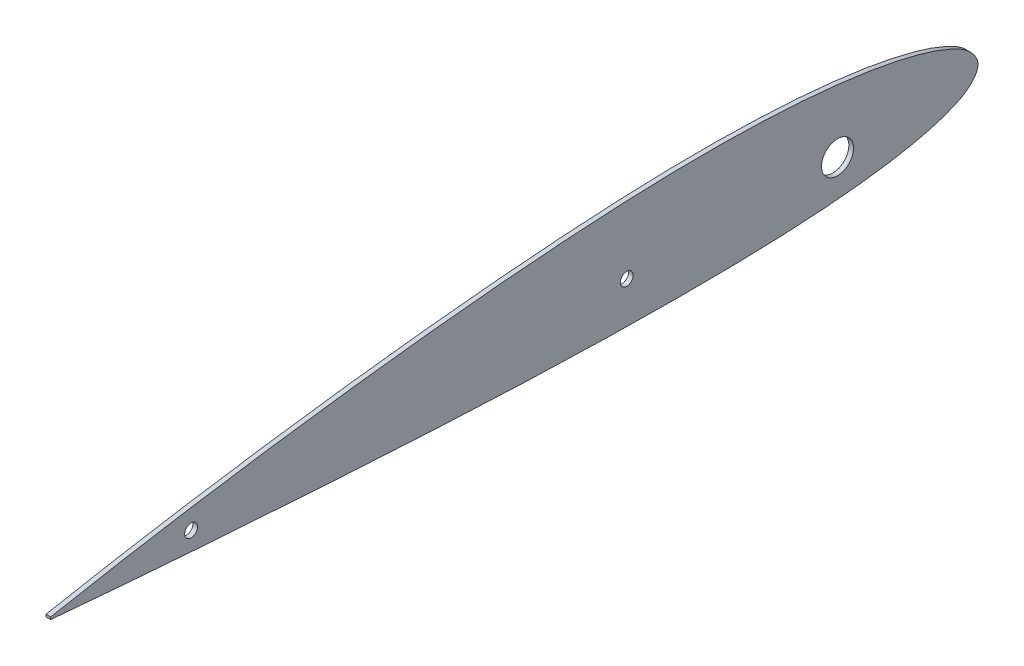
ISO-10303-21;
HEADER;
FILE_DESCRIPTION(('STEP AP214'),'2;1');
FILE_NAME('part.step','',(''),(''),'','','');
FILE_SCHEMA(('AUTOMOTIVE_DESIGN { 1 0 10303 214 1 1 1 1 }'));
ENDSEC;
DATA;
#1=APPLICATION_CONTEXT('core data for automotive mechanical design processes');
#2=APPLICATION_PROTOCOL_DEFINITION('international standard','automotive_design',2000,#1);
#3=PRODUCT_CONTEXT('',#1,'mechanical');
#4=PRODUCT('Part','Part','',(#3));
#5=PRODUCT_RELATED_PRODUCT_CATEGORY('part','',(#4));
#6=PRODUCT_DEFINITION_FORMATION('','',#4);
#7=PRODUCT_DEFINITION_CONTEXT('part definition',#1,'design');
#8=PRODUCT_DEFINITION('design','',#6,#7);
#9=PRODUCT_DEFINITION_SHAPE('','',#8);
#10=(LENGTH_UNIT() NAMED_UNIT(*) SI_UNIT(.MILLI.,.METRE.));
#11=(NAMED_UNIT(*) PLANE_ANGLE_UNIT() SI_UNIT($,.RADIAN.));
#12=(NAMED_UNIT(*) SI_UNIT($,.STERADIAN.) SOLID_ANGLE_UNIT());
#13=UNCERTAINTY_MEASURE_WITH_UNIT(LENGTH_MEASURE(1.E-05),#10,'distance_accuracy_value','');
#14=(GEOMETRIC_REPRESENTATION_CONTEXT(3) GLOBAL_UNCERTAINTY_ASSIGNED_CONTEXT((#13)) GLOBAL_UNIT_ASSIGNED_CONTEXT((#10,
#11,#12)) REPRESENTATION_CONTEXT('',''));
#15=CARTESIAN_POINT('',(0.,0.,0.));
#16=DIRECTION('',(0.,0.,1.));
#17=DIRECTION('',(1.,0.,0.));
#18=AXIS2_PLACEMENT_3D('',#15,#16,#17);
#19=CARTESIAN_POINT('',(2.,0.498957664068357,396.008399204064));
#20=CARTESIAN_POINT('',(2.,1.73324917257407,389.462824097327));
#21=CARTESIAN_POINT('',(2.,4.20215625721935,376.369955319783));
#22=CARTESIAN_POINT('',(2.,8.77900567412302,350.130346293088));
#23=CARTESIAN_POINT('',(2.,14.0370108986971,317.273965612811));
#24=CARTESIAN_POINT('',(2.,19.5929662233102,277.76445959175));
#25=CARTESIAN_POINT('',(2.,24.4037399033925,238.194413225107));
#26=CARTESIAN_POINT('',(2.,28.3208764066357,198.56394331414));
#27=CARTESIAN_POINT('',(2.,31.1952270471159,158.827321428666));
#28=CARTESIAN_POINT('',(2.,32.3234193150525,125.61900086419));
#29=CARTESIAN_POINT('',(2.,32.0395257163794,99.0074858278439));
#30=CARTESIAN_POINT('',(2.,31.1729262128993,79.044268017143));
#31=CARTESIAN_POINT('',(2.,29.4199636353484,59.0839890938735));
#32=CARTESIAN_POINT('',(2.,27.0481870541635,42.486203802644));
#33=CARTESIAN_POINT('',(2.,24.2275655596141,29.2572356455919));
#34=CARTESIAN_POINT('',(2.,21.4912227728783,19.2983873315742));
#35=CARTESIAN_POINT('',(2.,18.1647140893809,10.9239104465409));
#36=CARTESIAN_POINT('',(2.,14.17634919189,3.74171629045366));
#37=CARTESIAN_POINT('',(2.,6.58689480663482,-2.42797287766835));
#38=CARTESIAN_POINT('',(2.,-0.563654635578988,4.21190706297154));
#39=CARTESIAN_POINT('',(2.,-4.12388870461624,11.5742596023716));
#40=CARTESIAN_POINT('',(2.,-6.96541864369798,20.0561020853192));
#41=CARTESIAN_POINT('',(2.,-9.19541411840152,30.0479044695401));
#42=CARTESIAN_POINT('',(2.,-11.4195545459523,43.2389694781889));
#43=CARTESIAN_POINT('',(2.,-13.2285903250261,59.6923273816749));
#44=CARTESIAN_POINT('',(2.,-14.5220357650826,79.4128672165589));
#45=CARTESIAN_POINT('',(2.,-15.2010113058915,99.0942889329522));
#46=CARTESIAN_POINT('',(2.,-15.5242846387084,125.314305957217));
#47=CARTESIAN_POINT('',(2.,-15.1570321444092,158.156003808136));
#48=CARTESIAN_POINT('',(2.,-13.8837486847356,197.62397910927));
#49=CARTESIAN_POINT('',(2.,-11.9550708213805,237.184466624894));
#50=CARTESIAN_POINT('',(2.,-9.58198009525624,276.794221377206));
#51=CARTESIAN_POINT('',(2.,-6.89111674989328,316.465196196086));
#52=CARTESIAN_POINT('',(2.,-4.40038865873363,349.559664948341));
#53=CARTESIAN_POINT('',(2.,-2.24196380738565,376.07614004168));
#54=CARTESIAN_POINT('',(2.,-1.08043791892812,389.347649918621));
#55=CARTESIAN_POINT('',(2.,-0.498957664068361,395.991600795936));
#56=B_SPLINE_CURVE_WITH_KNOTS('',3,(#19,#20,#21,#22,#23,#24,#25,#26,#27,#28,#29,#30,#31,#32,#33,
#34,#35,#36,#37,#38,#39,#40,#41,#42,#43,#44,#45,#46,#47,#48,#49,#50,#51,#52,#53,#54,#55),
.UNSPECIFIED.,.F.,.F.,(4,1,1,1,1,1,1,1,1,1,1,1,1,1,1,1,1,1,1,1,1,1,1,1,1,1,1,1,1,1,1,1,1,1,4),
(0.,0.0247583527022921,0.0495232057983208,0.099002464419805,0.148431640988793,0.197816092678823,
0.247156978041538,0.296440500967814,0.345884085447012,0.370605915917013,0.395346156344423,
0.420138805885135,0.4450560288657,0.457622030352105,0.470360866612067,0.483523326653886,
0.490626325383128,0.501772115898221,0.512907946738326,0.519977099804335,0.533052484339323,
0.545674076898575,0.558115541146016,0.58272509680566,0.607174358189599,0.631557278595084,
0.65591625667648,0.704636043070596,0.753621853029336,0.80268738739157,0.851851697592658,
0.901113053173649,0.950481472331415,0.975210155559022,1.),.UNSPECIFIED.);
#57=DIRECTION('',(-1.,0.,0.));
#58=VECTOR('',#57,1.);
#59=SURFACE_OF_LINEAR_EXTRUSION('',#56,#58);
#60=CARTESIAN_POINT('',(0.,0.498957664068357,396.008399204064));
#61=CARTESIAN_POINT('',(0.,1.73324917257407,389.462824097327));
#62=CARTESIAN_POINT('',(0.,4.20215625721935,376.369955319783));
#63=CARTESIAN_POINT('',(0.,8.77900567412302,350.130346293088));
#64=CARTESIAN_POINT('',(0.,14.0370108986971,317.273965612811));
#65=CARTESIAN_POINT('',(0.,19.5929662233102,277.76445959175));
#66=CARTESIAN_POINT('',(0.,24.4037399033925,238.194413225107));
#67=CARTESIAN_POINT('',(0.,28.3208764066357,198.56394331414));
#68=CARTESIAN_POINT('',(0.,31.1952270471159,158.827321428666));
#69=CARTESIAN_POINT('',(0.,32.3234193150525,125.61900086419));
#70=CARTESIAN_POINT('',(0.,32.0395257163794,99.0074858278439));
#71=CARTESIAN_POINT('',(0.,31.1729262128993,79.044268017143));
#72=CARTESIAN_POINT('',(0.,29.4199636353484,59.0839890938735));
#73=CARTESIAN_POINT('',(0.,27.0481870541635,42.486203802644));
#74=CARTESIAN_POINT('',(0.,24.2275655596141,29.2572356455919));
#75=CARTESIAN_POINT('',(0.,21.4912227728783,19.2983873315742));
#76=CARTESIAN_POINT('',(0.,18.1647140893809,10.9239104465409));
#77=CARTESIAN_POINT('',(0.,14.17634919189,3.74171629045366));
#78=CARTESIAN_POINT('',(0.,6.58689480663482,-2.42797287766835));
#79=CARTESIAN_POINT('',(0.,-0.563654635578988,4.21190706297154));
#80=CARTESIAN_POINT('',(0.,-4.12388870461624,11.5742596023716));
#81=CARTESIAN_POINT('',(0.,-6.96541864369798,20.0561020853192));
#82=CARTESIAN_POINT('',(0.,-9.19541411840152,30.0479044695401));
#83=CARTESIAN_POINT('',(0.,-11.4195545459523,43.2389694781889));
#84=CARTESIAN_POINT('',(0.,-13.2285903250261,59.6923273816749));
#85=CARTESIAN_POINT('',(0.,-14.5220357650826,79.4128672165589));
#86=CARTESIAN_POINT('',(0.,-15.2010113058915,99.0942889329522));
#87=CARTESIAN_POINT('',(0.,-15.5242846387084,125.314305957217));
#88=CARTESIAN_POINT('',(0.,-15.1570321444092,158.156003808136));
#89=CARTESIAN_POINT('',(0.,-13.8837486847356,197.62397910927));
#90=CARTESIAN_POINT('',(0.,-11.9550708213805,237.184466624894));
#91=CARTESIAN_POINT('',(0.,-9.58198009525624,276.794221377206));
#92=CARTESIAN_POINT('',(0.,-6.89111674989328,316.465196196086));
#93=CARTESIAN_POINT('',(0.,-4.40038865873363,349.559664948341));
#94=CARTESIAN_POINT('',(0.,-2.24196380738565,376.07614004168));
#95=CARTESIAN_POINT('',(0.,-1.08043791892812,389.347649918621));
#96=CARTESIAN_POINT('',(0.,-0.498957664068361,395.991600795936));
#97=B_SPLINE_CURVE_WITH_KNOTS('',3,(#60,#61,#62,#63,#64,#65,#66,#67,#68,#69,#70,#71,#72,#73,#74,
#75,#76,#77,#78,#79,#80,#81,#82,#83,#84,#85,#86,#87,#88,#89,#90,#91,#92,#93,#94,#95,#96),
.UNSPECIFIED.,.F.,.F.,(4,1,1,1,1,1,1,1,1,1,1,1,1,1,1,1,1,1,1,1,1,1,1,1,1,1,1,1,1,1,1,1,1,1,4),
(0.,0.0247583527022921,0.0495232057983208,0.099002464419805,0.148431640988793,0.197816092678823,
0.247156978041538,0.296440500967814,0.345884085447012,0.370605915917013,0.395346156344423,
0.420138805885135,0.4450560288657,0.457622030352105,0.470360866612067,0.483523326653886,
0.490626325383128,0.501772115898221,0.512907946738326,0.519977099804335,0.533052484339323,
0.545674076898575,0.558115541146016,0.58272509680566,0.607174358189599,0.631557278595084,
0.65591625667648,0.704636043070596,0.753621853029336,0.80268738739157,0.851851697592658,
0.901113053173649,0.950481472331415,0.975210155559022,1.),.UNSPECIFIED.);
#98=CARTESIAN_POINT('',(0.,0.498957664068359,396.008399204064));
#99=VERTEX_POINT('',#98);
#100=CARTESIAN_POINT('',(0.,-0.498957664068359,395.991600795936));
#101=VERTEX_POINT('',#100);
#102=EDGE_CURVE('E67',#99,#101,#97,.T.);
#103=ORIENTED_EDGE('',*,*,#102,.F.);
#104=DIRECTION('',(-1.,0.,0.));
#105=VECTOR('',#104,1.);
#106=CARTESIAN_POINT('',(2.,0.498957664068359,396.008399204064));
#107=LINE('',#106,#105);
#108=CARTESIAN_POINT('',(2.,0.498957664068359,396.008399204064));
#109=VERTEX_POINT('',#108);
#110=EDGE_CURVE('E47',#109,#99,#107,.T.);
#111=ORIENTED_EDGE('',*,*,#110,.F.);
#112=CARTESIAN_POINT('',(2.,-0.498957664068359,395.991600795936));
#113=VERTEX_POINT('',#112);
#114=EDGE_CURVE('E68',#109,#113,#56,.T.);
#115=ORIENTED_EDGE('',*,*,#114,.T.);
#116=DIRECTION('',(-1.,0.,0.));
#117=VECTOR('',#116,1.);
#118=CARTESIAN_POINT('',(2.,-0.498957664068359,395.991600795936));
#119=LINE('',#118,#117);
#120=EDGE_CURVE('E11',#113,#101,#119,.T.);
#121=ORIENTED_EDGE('',*,*,#120,.T.);
#122=EDGE_LOOP('',(#103,#111,#115,#121));
#123=FACE_BOUND('',#122,.T.);
#124=ADVANCED_FACE('F37',(#123),#59,.T.);
#125=CARTESIAN_POINT('',(2.,0.498957664068359,396.008399204064));
#126=DIRECTION('',(0.,0.0168311159332552,-0.999858346735397));
#127=DIRECTION('',(0.,-0.999858346735397,-0.0168311159332552));
#128=AXIS2_PLACEMENT_3D('',#125,#126,#127);
#129=PLANE('',#128);
#130=DIRECTION('',(0.,0.999858346735397,0.0168311159332552));
#131=VECTOR('',#130,1.);
#132=CARTESIAN_POINT('',(0.,0.498957664068359,396.008399204064));
#133=LINE('',#132,#131);
#134=EDGE_CURVE('E62',#101,#99,#133,.T.);
#135=ORIENTED_EDGE('',*,*,#134,.F.);
#136=ORIENTED_EDGE('',*,*,#120,.F.);
#137=DIRECTION('',(0.,0.999858346735397,0.0168311159332552));
#138=VECTOR('',#137,1.);
#139=CARTESIAN_POINT('',(2.,0.498957664068359,396.008399204064));
#140=LINE('',#139,#138);
#141=EDGE_CURVE('E56',#113,#109,#140,.T.);
#142=ORIENTED_EDGE('',*,*,#141,.T.);
#143=ORIENTED_EDGE('',*,*,#110,.T.);
#144=EDGE_LOOP('',(#135,#136,#142,#143));
#145=FACE_BOUND('',#144,.T.);
#146=ADVANCED_FACE('F71',(#145),#129,.F.);
#147=CARTESIAN_POINT('',(2.,8.00244059002986,0.133276198651239));
#148=DIRECTION('',(-1.,0.,0.));
#149=DIRECTION('',(0.,0.,-1.));
#150=AXIS2_PLACEMENT_3D('',#147,#148,#149);
#151=PLANE('',#150);
#152=CARTESIAN_POINT('',(2.,2.5000018824215,60.));
#153=DIRECTION('',(-1.,0.,0.));
#154=DIRECTION('',(0.,0.,1.));
#155=AXIS2_PLACEMENT_3D('',#152,#153,#154);
#156=CIRCLE('',#155,6.83635541999999);
#157=CARTESIAN_POINT('',(2.,2.5000018824215,66.83635542));
#158=VERTEX_POINT('',#157);
#159=EDGE_CURVE('E87',#158,#158,#156,.T.);
#160=ORIENTED_EDGE('',*,*,#159,.T.);
#161=EDGE_LOOP('',(#160));
#162=FACE_BOUND('',#161,.T.);
#163=CARTESIAN_POINT('',(2.,2.5000018824215,150.));
#164=DIRECTION('',(-1.,0.,0.));
#165=DIRECTION('',(0.,0.,1.));
#166=AXIS2_PLACEMENT_3D('',#163,#164,#165);
#167=CIRCLE('',#166,2.75000000000001);
#168=CARTESIAN_POINT('',(2.,2.5000018824215,152.75));
#169=VERTEX_POINT('',#168);
#170=EDGE_CURVE('E101',#169,#169,#167,.T.);
#171=ORIENTED_EDGE('',*,*,#170,.T.);
#172=EDGE_LOOP('',(#171));
#173=FACE_BOUND('',#172,.T.);
#174=CARTESIAN_POINT('',(2.,2.50000188242148,336.033583382836));
#175=DIRECTION('',(-1.,0.,0.));
#176=DIRECTION('',(0.,0.,1.));
#177=AXIS2_PLACEMENT_3D('',#174,#175,#176);
#178=CIRCLE('',#177,2.75000000000004);
#179=CARTESIAN_POINT('',(2.,2.50000188242148,338.783583382836));
#180=VERTEX_POINT('',#179);
#181=EDGE_CURVE('E103',#180,#180,#178,.T.);
#182=ORIENTED_EDGE('',*,*,#181,.T.);
#183=EDGE_LOOP('',(#182));
#184=FACE_BOUND('',#183,.T.);
#185=ORIENTED_EDGE('',*,*,#114,.F.);
#186=ORIENTED_EDGE('',*,*,#141,.F.);
#187=EDGE_LOOP('',(#185,#186));
#188=FACE_BOUND('',#187,.T.);
#189=ADVANCED_FACE('F116',(#162,#173,#184,#188),#151,.F.);
#190=CARTESIAN_POINT('',(0.,8.00244059002986,0.133276198651239));
#191=DIRECTION('',(-1.,0.,0.));
#192=DIRECTION('',(0.,0.,-1.));
#193=AXIS2_PLACEMENT_3D('',#190,#191,#192);
#194=PLANE('',#193);
#195=CARTESIAN_POINT('',(0.,2.5000018824215,60.));
#196=DIRECTION('',(1.,0.,0.));
#197=DIRECTION('',(0.,0.,-1.));
#198=AXIS2_PLACEMENT_3D('',#195,#196,#197);
#199=CIRCLE('',#198,6.83635541999999);
#200=CARTESIAN_POINT('',(0.,2.5000018824215,66.83635542));
#201=VERTEX_POINT('',#200);
#202=EDGE_CURVE('E41',#201,#201,#199,.T.);
#203=ORIENTED_EDGE('',*,*,#202,.T.);
#204=EDGE_LOOP('',(#203));
#205=FACE_BOUND('',#204,.T.);
#206=CARTESIAN_POINT('',(0.,2.5000018824215,150.));
#207=DIRECTION('',(1.,0.,0.));
#208=DIRECTION('',(0.,0.,-1.));
#209=AXIS2_PLACEMENT_3D('',#206,#207,#208);
#210=CIRCLE('',#209,2.75000000000001);
#211=CARTESIAN_POINT('',(0.,2.5000018824215,152.75));
#212=VERTEX_POINT('',#211);
#213=EDGE_CURVE('E77',#212,#212,#210,.T.);
#214=ORIENTED_EDGE('',*,*,#213,.T.);
#215=EDGE_LOOP('',(#214));
#216=FACE_BOUND('',#215,.T.);
#217=CARTESIAN_POINT('',(0.,2.50000188242148,336.033583382836));
#218=DIRECTION('',(1.,0.,0.));
#219=DIRECTION('',(0.,0.,-1.));
#220=AXIS2_PLACEMENT_3D('',#217,#218,#219);
#221=CIRCLE('',#220,2.75000000000004);
#222=CARTESIAN_POINT('',(0.,2.50000188242148,338.783583382836));
#223=VERTEX_POINT('',#222);
#224=EDGE_CURVE('E85',#223,#223,#221,.T.);
#225=ORIENTED_EDGE('',*,*,#224,.T.);
#226=EDGE_LOOP('',(#225));
#227=FACE_BOUND('',#226,.T.);
#228=ORIENTED_EDGE('',*,*,#102,.T.);
#229=ORIENTED_EDGE('',*,*,#134,.T.);
#230=EDGE_LOOP('',(#228,#229));
#231=FACE_BOUND('',#230,.T.);
#232=ADVANCED_FACE('F65',(#205,#216,#227,#231),#194,.T.);
#233=CARTESIAN_POINT('',(-1.2E-05,2.50000188242148,336.033583382836));
#234=DIRECTION('',(1.,0.,0.));
#235=DIRECTION('',(0.,0.,1.));
#236=AXIS2_PLACEMENT_3D('',#233,#234,#235);
#237=CYLINDRICAL_SURFACE('',#236,2.75000000000004);
#238=CARTESIAN_POINT('',(0.,2.50000188242148,338.783583382836));
#239=CARTESIAN_POINT('',(0.0208333333333333,2.50000188242148,338.783583382836));
#240=CARTESIAN_POINT('',(0.0416666666666667,2.50000188242148,338.783583382836));
#241=CARTESIAN_POINT('',(0.0833333333333333,2.50000188242148,338.783583382836));
#242=CARTESIAN_POINT('',(0.104166666666667,2.50000188242148,338.783583382836));
#243=CARTESIAN_POINT('',(0.145833333333333,2.50000188242148,338.783583382836));
#244=CARTESIAN_POINT('',(0.166666666666667,2.50000188242148,338.783583382836));
#245=CARTESIAN_POINT('',(0.208333333333333,2.50000188242148,338.783583382836));
#246=CARTESIAN_POINT('',(0.229166666666667,2.50000188242148,338.783583382836));
#247=CARTESIAN_POINT('',(0.270833333333333,2.50000188242148,338.783583382836));
#248=CARTESIAN_POINT('',(0.291666666666667,2.50000188242148,338.783583382836));
#249=CARTESIAN_POINT('',(0.333333333333333,2.50000188242148,338.783583382836));
#250=CARTESIAN_POINT('',(0.354166666666667,2.50000188242148,338.783583382836));
#251=CARTESIAN_POINT('',(0.395833333333333,2.50000188242148,338.783583382836));
#252=CARTESIAN_POINT('',(0.416666666666667,2.50000188242148,338.783583382836));
#253=CARTESIAN_POINT('',(0.458333333333333,2.50000188242148,338.783583382836));
#254=CARTESIAN_POINT('',(0.479166666666667,2.50000188242148,338.783583382836));
#255=CARTESIAN_POINT('',(0.520833333333333,2.50000188242148,338.783583382836));
#256=CARTESIAN_POINT('',(0.541666666666667,2.50000188242148,338.783583382836));
#257=CARTESIAN_POINT('',(0.583333333333333,2.50000188242148,338.783583382836));
#258=CARTESIAN_POINT('',(0.604166666666667,2.50000188242148,338.783583382836));
#259=CARTESIAN_POINT('',(0.645833333333333,2.50000188242148,338.783583382836));
#260=CARTESIAN_POINT('',(0.666666666666667,2.50000188242148,338.783583382836));
#261=CARTESIAN_POINT('',(0.708333333333333,2.50000188242148,338.783583382836));
#262=CARTESIAN_POINT('',(0.729166666666667,2.50000188242148,338.783583382836));
#263=CARTESIAN_POINT('',(0.770833333333333,2.50000188242148,338.783583382836));
#264=CARTESIAN_POINT('',(0.791666666666667,2.50000188242148,338.783583382836));
#265=CARTESIAN_POINT('',(0.833333333333333,2.50000188242148,338.783583382836));
#266=CARTESIAN_POINT('',(0.854166666666667,2.50000188242148,338.783583382836));
#267=CARTESIAN_POINT('',(0.895833333333333,2.50000188242148,338.783583382836));
#268=CARTESIAN_POINT('',(0.916666666666667,2.50000188242148,338.783583382836));
#269=CARTESIAN_POINT('',(0.958333333333333,2.50000188242148,338.783583382836));
#270=CARTESIAN_POINT('',(0.979166666666667,2.50000188242148,338.783583382836));
#271=CARTESIAN_POINT('',(1.02083333333333,2.50000188242148,338.783583382836));
#272=CARTESIAN_POINT('',(1.04166666666667,2.50000188242148,338.783583382836));
#273=CARTESIAN_POINT('',(1.08333333333333,2.50000188242148,338.783583382836));
#274=CARTESIAN_POINT('',(1.10416666666667,2.50000188242148,338.783583382836));
#275=CARTESIAN_POINT('',(1.14583333333333,2.50000188242148,338.783583382836));
#276=CARTESIAN_POINT('',(1.16666666666667,2.50000188242148,338.783583382836));
#277=CARTESIAN_POINT('',(1.20833333333333,2.50000188242148,338.783583382836));
#278=CARTESIAN_POINT('',(1.22916666666667,2.50000188242148,338.783583382836));
#279=CARTESIAN_POINT('',(1.27083333333333,2.50000188242148,338.783583382836));
#280=CARTESIAN_POINT('',(1.29166666666667,2.50000188242148,338.783583382836));
#281=CARTESIAN_POINT('',(1.33333333333333,2.50000188242148,338.783583382836));
#282=CARTESIAN_POINT('',(1.35416666666667,2.50000188242148,338.783583382836));
#283=CARTESIAN_POINT('',(1.39583333333333,2.50000188242148,338.783583382836));
#284=CARTESIAN_POINT('',(1.41666666666667,2.50000188242148,338.783583382836));
#285=CARTESIAN_POINT('',(1.45833333333333,2.50000188242148,338.783583382836));
#286=CARTESIAN_POINT('',(1.47916666666667,2.50000188242148,338.783583382836));
#287=CARTESIAN_POINT('',(1.52083333333333,2.50000188242148,338.783583382836));
#288=CARTESIAN_POINT('',(1.54166666666667,2.50000188242148,338.783583382836));
#289=CARTESIAN_POINT('',(1.58333333333333,2.50000188242148,338.783583382836));
#290=CARTESIAN_POINT('',(1.60416666666667,2.50000188242148,338.783583382836));
#291=CARTESIAN_POINT('',(1.64583333333333,2.50000188242148,338.783583382836));
#292=CARTESIAN_POINT('',(1.66666666666667,2.50000188242148,338.783583382836));
#293=CARTESIAN_POINT('',(1.70833333333333,2.50000188242148,338.783583382836));
#294=CARTESIAN_POINT('',(1.72916666666667,2.50000188242148,338.783583382836));
#295=CARTESIAN_POINT('',(1.77083333333333,2.50000188242148,338.783583382836));
#296=CARTESIAN_POINT('',(1.79166666666667,2.50000188242148,338.783583382836));
#297=CARTESIAN_POINT('',(1.83333333333333,2.50000188242148,338.783583382836));
#298=CARTESIAN_POINT('',(1.85416666666667,2.50000188242148,338.783583382836));
#299=CARTESIAN_POINT('',(1.89583333333333,2.50000188242148,338.783583382836));
#300=CARTESIAN_POINT('',(1.91666666666667,2.50000188242148,338.783583382836));
#301=CARTESIAN_POINT('',(1.95833333333333,2.50000188242148,338.783583382836));
#302=CARTESIAN_POINT('',(1.97916666666667,2.50000188242148,338.783583382836));
#303=CARTESIAN_POINT('',(2.,2.50000188242148,338.783583382836));
#304=B_SPLINE_CURVE_WITH_KNOTS('',3,(#238,#239,#240,#241,#242,#243,#244,#245,#246,#247,#248,
#249,#250,#251,#252,#253,#254,#255,#256,#257,#258,#259,#260,#261,#262,#263,#264,#265,#266,#267,
#268,#269,#270,#271,#272,#273,#274,#275,#276,#277,#278,#279,#280,#281,#282,#283,#284,#285,#286,
#287,#288,#289,#290,#291,#292,#293,#294,#295,#296,#297,#298,#299,#300,#301,#302,#303),
.UNSPECIFIED.,.F.,.F.,(4,2,2,2,2,2,2,2,2,2,2,2,2,2,2,2,2,2,2,2,2,2,2,2,2,2,2,2,2,2,2,2,4),(0.,
0.0625,0.125,0.1875,0.25,0.3125,0.375,0.4375,0.5,0.5625,0.625,0.6875,0.75,0.8125,0.875,0.9375,
1.,1.0625,1.125,1.1875,1.25,1.3125,1.375,1.4375,1.5,1.5625,1.625,1.6875,1.75,1.8125,1.875,
1.9375,2.),.UNSPECIFIED.);
#305=EDGE_CURVE('BSEAM97',#223,#180,#304,.T.);
#306=ORIENTED_EDGE('',*,*,#224,.F.);
#307=ORIENTED_EDGE('',*,*,#181,.F.);
#308=ORIENTED_EDGE('',*,*,#305,.T.);
#309=ORIENTED_EDGE('',*,*,#305,.F.);
#310=EDGE_LOOP('',(#306,#308,#307,#309));
#311=FACE_BOUND('',#310,.T.);
#312=ADVANCED_FACE('F97',(#311),#237,.F.);
#313=CARTESIAN_POINT('',(-1.2E-05,2.5000018824215,150.));
#314=DIRECTION('',(1.,0.,0.));
#315=DIRECTION('',(0.,0.,1.));
#316=AXIS2_PLACEMENT_3D('',#313,#314,#315);
#317=CYLINDRICAL_SURFACE('',#316,2.75000000000001);
#318=CARTESIAN_POINT('',(0.,2.5000018824215,152.75));
#319=CARTESIAN_POINT('',(0.0208333333333333,2.5000018824215,152.75));
#320=CARTESIAN_POINT('',(0.0416666666666667,2.5000018824215,152.75));
#321=CARTESIAN_POINT('',(0.0833333333333333,2.5000018824215,152.75));
#322=CARTESIAN_POINT('',(0.104166666666667,2.5000018824215,152.75));
#323=CARTESIAN_POINT('',(0.145833333333333,2.5000018824215,152.75));
#324=CARTESIAN_POINT('',(0.166666666666667,2.5000018824215,152.75));
#325=CARTESIAN_POINT('',(0.208333333333333,2.5000018824215,152.75));
#326=CARTESIAN_POINT('',(0.229166666666667,2.5000018824215,152.75));
#327=CARTESIAN_POINT('',(0.270833333333333,2.5000018824215,152.75));
#328=CARTESIAN_POINT('',(0.291666666666667,2.5000018824215,152.75));
#329=CARTESIAN_POINT('',(0.333333333333333,2.5000018824215,152.75));
#330=CARTESIAN_POINT('',(0.354166666666667,2.5000018824215,152.75));
#331=CARTESIAN_POINT('',(0.395833333333333,2.5000018824215,152.75));
#332=CARTESIAN_POINT('',(0.416666666666667,2.5000018824215,152.75));
#333=CARTESIAN_POINT('',(0.458333333333333,2.5000018824215,152.75));
#334=CARTESIAN_POINT('',(0.479166666666667,2.5000018824215,152.75));
#335=CARTESIAN_POINT('',(0.520833333333333,2.5000018824215,152.75));
#336=CARTESIAN_POINT('',(0.541666666666667,2.5000018824215,152.75));
#337=CARTESIAN_POINT('',(0.583333333333333,2.5000018824215,152.75));
#338=CARTESIAN_POINT('',(0.604166666666667,2.5000018824215,152.75));
#339=CARTESIAN_POINT('',(0.645833333333333,2.5000018824215,152.75));
#340=CARTESIAN_POINT('',(0.666666666666667,2.5000018824215,152.75));
#341=CARTESIAN_POINT('',(0.708333333333333,2.5000018824215,152.75));
#342=CARTESIAN_POINT('',(0.729166666666667,2.5000018824215,152.75));
#343=CARTESIAN_POINT('',(0.770833333333333,2.5000018824215,152.75));
#344=CARTESIAN_POINT('',(0.791666666666667,2.5000018824215,152.75));
#345=CARTESIAN_POINT('',(0.833333333333333,2.5000018824215,152.75));
#346=CARTESIAN_POINT('',(0.854166666666667,2.5000018824215,152.75));
#347=CARTESIAN_POINT('',(0.895833333333333,2.5000018824215,152.75));
#348=CARTESIAN_POINT('',(0.916666666666667,2.5000018824215,152.75));
#349=CARTESIAN_POINT('',(0.958333333333333,2.5000018824215,152.75));
#350=CARTESIAN_POINT('',(0.979166666666667,2.5000018824215,152.75));
#351=CARTESIAN_POINT('',(1.02083333333333,2.5000018824215,152.75));
#352=CARTESIAN_POINT('',(1.04166666666667,2.5000018824215,152.75));
#353=CARTESIAN_POINT('',(1.08333333333333,2.5000018824215,152.75));
#354=CARTESIAN_POINT('',(1.10416666666667,2.5000018824215,152.75));
#355=CARTESIAN_POINT('',(1.14583333333333,2.5000018824215,152.75));
#356=CARTESIAN_POINT('',(1.16666666666667,2.5000018824215,152.75));
#357=CARTESIAN_POINT('',(1.20833333333333,2.5000018824215,152.75));
#358=CARTESIAN_POINT('',(1.22916666666667,2.5000018824215,152.75));
#359=CARTESIAN_POINT('',(1.27083333333333,2.5000018824215,152.75));
#360=CARTESIAN_POINT('',(1.29166666666667,2.5000018824215,152.75));
#361=CARTESIAN_POINT('',(1.33333333333333,2.5000018824215,152.75));
#362=CARTESIAN_POINT('',(1.35416666666667,2.5000018824215,152.75));
#363=CARTESIAN_POINT('',(1.39583333333333,2.5000018824215,152.75));
#364=CARTESIAN_POINT('',(1.41666666666667,2.5000018824215,152.75));
#365=CARTESIAN_POINT('',(1.45833333333333,2.5000018824215,152.75));
#366=CARTESIAN_POINT('',(1.47916666666667,2.5000018824215,152.75));
#367=CARTESIAN_POINT('',(1.52083333333333,2.5000018824215,152.75));
#368=CARTESIAN_POINT('',(1.54166666666667,2.5000018824215,152.75));
#369=CARTESIAN_POINT('',(1.58333333333333,2.5000018824215,152.75));
#370=CARTESIAN_POINT('',(1.60416666666667,2.5000018824215,152.75));
#371=CARTESIAN_POINT('',(1.64583333333333,2.5000018824215,152.75));
#372=CARTESIAN_POINT('',(1.66666666666667,2.5000018824215,152.75));
#373=CARTESIAN_POINT('',(1.70833333333333,2.5000018824215,152.75));
#374=CARTESIAN_POINT('',(1.72916666666667,2.5000018824215,152.75));
#375=CARTESIAN_POINT('',(1.77083333333333,2.5000018824215,152.75));
#376=CARTESIAN_POINT('',(1.79166666666667,2.5000018824215,152.75));
#377=CARTESIAN_POINT('',(1.83333333333333,2.5000018824215,152.75));
#378=CARTESIAN_POINT('',(1.85416666666667,2.5000018824215,152.75));
#379=CARTESIAN_POINT('',(1.89583333333333,2.5000018824215,152.75));
#380=CARTESIAN_POINT('',(1.91666666666667,2.5000018824215,152.75));
#381=CARTESIAN_POINT('',(1.95833333333333,2.5000018824215,152.75));
#382=CARTESIAN_POINT('',(1.97916666666667,2.5000018824215,152.75));
#383=CARTESIAN_POINT('',(2.,2.5000018824215,152.75));
#384=B_SPLINE_CURVE_WITH_KNOTS('',3,(#318,#319,#320,#321,#322,#323,#324,#325,#326,#327,#328,
#329,#330,#331,#332,#333,#334,#335,#336,#337,#338,#339,#340,#341,#342,#343,#344,#345,#346,#347,
#348,#349,#350,#351,#352,#353,#354,#355,#356,#357,#358,#359,#360,#361,#362,#363,#364,#365,#366,
#367,#368,#369,#370,#371,#372,#373,#374,#375,#376,#377,#378,#379,#380,#381,#382,#383),
.UNSPECIFIED.,.F.,.F.,(4,2,2,2,2,2,2,2,2,2,2,2,2,2,2,2,2,2,2,2,2,2,2,2,2,2,2,2,2,2,2,2,4),(0.,
0.0625,0.125,0.1875,0.25,0.3125,0.375,0.4375,0.5,0.5625,0.625,0.6875,0.75,0.8125,0.875,0.9375,
1.,1.0625,1.125,1.1875,1.25,1.3125,1.375,1.4375,1.5,1.5625,1.625,1.6875,1.75,1.8125,1.875,
1.9375,2.),.UNSPECIFIED.);
#385=EDGE_CURVE('BSEAM93',#212,#169,#384,.T.);
#386=ORIENTED_EDGE('',*,*,#213,.F.);
#387=ORIENTED_EDGE('',*,*,#170,.F.);
#388=ORIENTED_EDGE('',*,*,#385,.T.);
#389=ORIENTED_EDGE('',*,*,#385,.F.);
#390=EDGE_LOOP('',(#386,#388,#387,#389));
#391=FACE_BOUND('',#390,.T.);
#392=ADVANCED_FACE('F93',(#391),#317,.F.);
#393=CARTESIAN_POINT('',(-1.2E-05,2.5000018824215,60.));
#394=DIRECTION('',(1.,0.,0.));
#395=DIRECTION('',(0.,0.,1.));
#396=AXIS2_PLACEMENT_3D('',#393,#394,#395);
#397=CYLINDRICAL_SURFACE('',#396,6.83635541999999);
#398=CARTESIAN_POINT('',(0.,2.5000018824215,66.83635542));
#399=CARTESIAN_POINT('',(0.0208333333333333,2.5000018824215,66.83635542));
#400=CARTESIAN_POINT('',(0.0416666666666667,2.5000018824215,66.83635542));
#401=CARTESIAN_POINT('',(0.0833333333333333,2.5000018824215,66.83635542));
#402=CARTESIAN_POINT('',(0.104166666666667,2.5000018824215,66.83635542));
#403=CARTESIAN_POINT('',(0.145833333333333,2.5000018824215,66.83635542));
#404=CARTESIAN_POINT('',(0.166666666666667,2.5000018824215,66.83635542));
#405=CARTESIAN_POINT('',(0.208333333333333,2.5000018824215,66.83635542));
#406=CARTESIAN_POINT('',(0.229166666666667,2.5000018824215,66.83635542));
#407=CARTESIAN_POINT('',(0.270833333333333,2.5000018824215,66.83635542));
#408=CARTESIAN_POINT('',(0.291666666666667,2.5000018824215,66.83635542));
#409=CARTESIAN_POINT('',(0.333333333333333,2.5000018824215,66.83635542));
#410=CARTESIAN_POINT('',(0.354166666666667,2.5000018824215,66.83635542));
#411=CARTESIAN_POINT('',(0.395833333333333,2.5000018824215,66.83635542));
#412=CARTESIAN_POINT('',(0.416666666666667,2.5000018824215,66.83635542));
#413=CARTESIAN_POINT('',(0.458333333333333,2.5000018824215,66.83635542));
#414=CARTESIAN_POINT('',(0.479166666666667,2.5000018824215,66.83635542));
#415=CARTESIAN_POINT('',(0.520833333333333,2.5000018824215,66.83635542));
#416=CARTESIAN_POINT('',(0.541666666666667,2.5000018824215,66.83635542));
#417=CARTESIAN_POINT('',(0.583333333333333,2.5000018824215,66.83635542));
#418=CARTESIAN_POINT('',(0.604166666666667,2.5000018824215,66.83635542));
#419=CARTESIAN_POINT('',(0.645833333333333,2.5000018824215,66.83635542));
#420=CARTESIAN_POINT('',(0.666666666666667,2.5000018824215,66.83635542));
#421=CARTESIAN_POINT('',(0.708333333333333,2.5000018824215,66.83635542));
#422=CARTESIAN_POINT('',(0.729166666666667,2.5000018824215,66.83635542));
#423=CARTESIAN_POINT('',(0.770833333333333,2.5000018824215,66.83635542));
#424=CARTESIAN_POINT('',(0.791666666666667,2.5000018824215,66.83635542));
#425=CARTESIAN_POINT('',(0.833333333333333,2.5000018824215,66.83635542));
#426=CARTESIAN_POINT('',(0.854166666666667,2.5000018824215,66.83635542));
#427=CARTESIAN_POINT('',(0.895833333333333,2.5000018824215,66.83635542));
#428=CARTESIAN_POINT('',(0.916666666666667,2.5000018824215,66.83635542));
#429=CARTESIAN_POINT('',(0.958333333333333,2.5000018824215,66.83635542));
#430=CARTESIAN_POINT('',(0.979166666666667,2.5000018824215,66.83635542));
#431=CARTESIAN_POINT('',(1.02083333333333,2.5000018824215,66.83635542));
#432=CARTESIAN_POINT('',(1.04166666666667,2.5000018824215,66.83635542));
#433=CARTESIAN_POINT('',(1.08333333333333,2.5000018824215,66.83635542));
#434=CARTESIAN_POINT('',(1.10416666666667,2.5000018824215,66.83635542));
#435=CARTESIAN_POINT('',(1.14583333333333,2.5000018824215,66.83635542));
#436=CARTESIAN_POINT('',(1.16666666666667,2.5000018824215,66.83635542));
#437=CARTESIAN_POINT('',(1.20833333333333,2.5000018824215,66.83635542));
#438=CARTESIAN_POINT('',(1.22916666666667,2.5000018824215,66.83635542));
#439=CARTESIAN_POINT('',(1.27083333333333,2.5000018824215,66.83635542));
#440=CARTESIAN_POINT('',(1.29166666666667,2.5000018824215,66.83635542));
#441=CARTESIAN_POINT('',(1.33333333333333,2.5000018824215,66.83635542));
#442=CARTESIAN_POINT('',(1.35416666666667,2.5000018824215,66.83635542));
#443=CARTESIAN_POINT('',(1.39583333333333,2.5000018824215,66.83635542));
#444=CARTESIAN_POINT('',(1.41666666666667,2.5000018824215,66.83635542));
#445=CARTESIAN_POINT('',(1.45833333333333,2.5000018824215,66.83635542));
#446=CARTESIAN_POINT('',(1.47916666666667,2.5000018824215,66.83635542));
#447=CARTESIAN_POINT('',(1.52083333333333,2.5000018824215,66.83635542));
#448=CARTESIAN_POINT('',(1.54166666666667,2.5000018824215,66.83635542));
#449=CARTESIAN_POINT('',(1.58333333333333,2.5000018824215,66.83635542));
#450=CARTESIAN_POINT('',(1.60416666666667,2.5000018824215,66.83635542));
#451=CARTESIAN_POINT('',(1.64583333333333,2.5000018824215,66.83635542));
#452=CARTESIAN_POINT('',(1.66666666666667,2.5000018824215,66.83635542));
#453=CARTESIAN_POINT('',(1.70833333333333,2.5000018824215,66.83635542));
#454=CARTESIAN_POINT('',(1.72916666666667,2.5000018824215,66.83635542));
#455=CARTESIAN_POINT('',(1.77083333333333,2.5000018824215,66.83635542));
#456=CARTESIAN_POINT('',(1.79166666666667,2.5000018824215,66.83635542));
#457=CARTESIAN_POINT('',(1.83333333333333,2.5000018824215,66.83635542));
#458=CARTESIAN_POINT('',(1.85416666666667,2.5000018824215,66.83635542));
#459=CARTESIAN_POINT('',(1.89583333333333,2.5000018824215,66.83635542));
#460=CARTESIAN_POINT('',(1.91666666666667,2.5000018824215,66.83635542));
#461=CARTESIAN_POINT('',(1.95833333333333,2.5000018824215,66.83635542));
#462=CARTESIAN_POINT('',(1.97916666666667,2.5000018824215,66.83635542));
#463=CARTESIAN_POINT('',(2.,2.5000018824215,66.83635542));
#464=B_SPLINE_CURVE_WITH_KNOTS('',3,(#398,#399,#400,#401,#402,#403,#404,#405,#406,#407,#408,
#409,#410,#411,#412,#413,#414,#415,#416,#417,#418,#419,#420,#421,#422,#423,#424,#425,#426,#427,
#428,#429,#430,#431,#432,#433,#434,#435,#436,#437,#438,#439,#440,#441,#442,#443,#444,#445,#446,
#447,#448,#449,#450,#451,#452,#453,#454,#455,#456,#457,#458,#459,#460,#461,#462,#463),
.UNSPECIFIED.,.F.,.F.,(4,2,2,2,2,2,2,2,2,2,2,2,2,2,2,2,2,2,2,2,2,2,2,2,2,2,2,2,2,2,2,2,4),(0.,
0.0625,0.125,0.1875,0.25,0.3125,0.375,0.4375,0.5,0.5625,0.625,0.6875,0.75,0.8125,0.875,0.9375,
1.,1.0625,1.125,1.1875,1.25,1.3125,1.375,1.4375,1.5,1.5625,1.625,1.6875,1.75,1.8125,1.875,
1.9375,2.),.UNSPECIFIED.);
#465=EDGE_CURVE('BSEAM96',#201,#158,#464,.T.);
#466=ORIENTED_EDGE('',*,*,#202,.F.);
#467=ORIENTED_EDGE('',*,*,#159,.F.);
#468=ORIENTED_EDGE('',*,*,#465,.T.);
#469=ORIENTED_EDGE('',*,*,#465,.F.);
#470=EDGE_LOOP('',(#466,#468,#467,#469));
#471=FACE_BOUND('',#470,.T.);
#472=ADVANCED_FACE('F96',(#471),#397,.F.);
#473=CLOSED_SHELL('',(#124,#146,#189,#232,#312,#392,#472));
#474=MANIFOLD_SOLID_BREP('B2',#473);
#475=ADVANCED_BREP_SHAPE_REPRESENTATION('',(#18,#474),#14);
#476=SHAPE_DEFINITION_REPRESENTATION(#9,#475);
ENDSEC;
END-ISO-10303-21;
